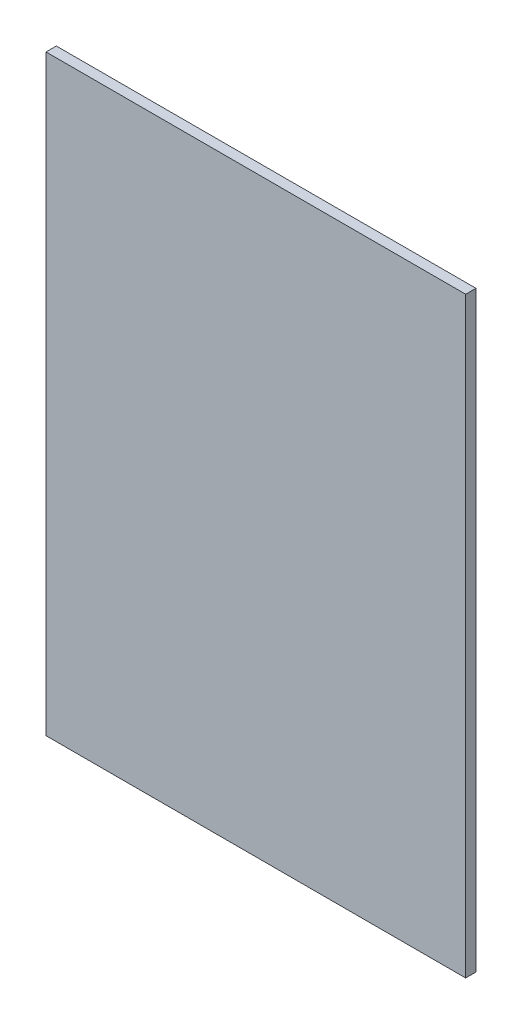
ISO-10303-21;
HEADER;
FILE_DESCRIPTION(('STEP AP214'),'2;1');
FILE_NAME('part.step','',(''),(''),'','','');
FILE_SCHEMA(('AUTOMOTIVE_DESIGN { 1 0 10303 214 1 1 1 1 }'));
ENDSEC;
DATA;
#1=APPLICATION_CONTEXT('core data for automotive mechanical design processes');
#2=APPLICATION_PROTOCOL_DEFINITION('international standard','automotive_design',2000,#1);
#3=PRODUCT_CONTEXT('',#1,'mechanical');
#4=PRODUCT('Part','Part','',(#3));
#5=PRODUCT_RELATED_PRODUCT_CATEGORY('part','',(#4));
#6=PRODUCT_DEFINITION_FORMATION('','',#4);
#7=PRODUCT_DEFINITION_CONTEXT('part definition',#1,'design');
#8=PRODUCT_DEFINITION('design','',#6,#7);
#9=PRODUCT_DEFINITION_SHAPE('','',#8);
#10=(LENGTH_UNIT() NAMED_UNIT(*) SI_UNIT(.MILLI.,.METRE.));
#11=(NAMED_UNIT(*) PLANE_ANGLE_UNIT() SI_UNIT($,.RADIAN.));
#12=(NAMED_UNIT(*) SI_UNIT($,.STERADIAN.) SOLID_ANGLE_UNIT());
#13=UNCERTAINTY_MEASURE_WITH_UNIT(LENGTH_MEASURE(1.E-05),#10,'distance_accuracy_value','');
#14=(GEOMETRIC_REPRESENTATION_CONTEXT(3) GLOBAL_UNCERTAINTY_ASSIGNED_CONTEXT((#13)) GLOBAL_UNIT_ASSIGNED_CONTEXT((#10,
#11,#12)) REPRESENTATION_CONTEXT('',''));
#15=CARTESIAN_POINT('',(0.,0.,0.));
#16=DIRECTION('',(0.,0.,1.));
#17=DIRECTION('',(1.,0.,0.));
#18=AXIS2_PLACEMENT_3D('',#15,#16,#17);
#19=CARTESIAN_POINT('',(103.505,146.05,2.54));
#20=DIRECTION('',(-1.,0.,0.));
#21=DIRECTION('',(0.,-1.,0.));
#22=AXIS2_PLACEMENT_3D('',#19,#20,#21);
#23=PLANE('',#22);
#24=DIRECTION('',(0.,1.,0.));
#25=VECTOR('',#24,1.);
#26=CARTESIAN_POINT('',(103.505,146.05,-2.54));
#27=LINE('',#26,#25);
#28=CARTESIAN_POINT('',(103.505,-146.05,-2.54));
#29=VERTEX_POINT('',#28);
#30=CARTESIAN_POINT('',(103.505,146.05,-2.54));
#31=VERTEX_POINT('',#30);
#32=EDGE_CURVE('E98',#29,#31,#27,.T.);
#33=ORIENTED_EDGE('',*,*,#32,.T.);
#34=DIRECTION('',(0.,0.,-1.));
#35=VECTOR('',#34,1.);
#36=CARTESIAN_POINT('',(103.505,146.05,2.54));
#37=LINE('',#36,#35);
#38=CARTESIAN_POINT('',(103.505,146.05,2.54));
#39=VERTEX_POINT('',#38);
#40=EDGE_CURVE('E11',#39,#31,#37,.T.);
#41=ORIENTED_EDGE('',*,*,#40,.F.);
#42=DIRECTION('',(0.,1.,0.));
#43=VECTOR('',#42,1.);
#44=CARTESIAN_POINT('',(103.505,146.05,2.54));
#45=LINE('',#44,#43);
#46=CARTESIAN_POINT('',(103.505,-146.05,2.54));
#47=VERTEX_POINT('',#46);
#48=EDGE_CURVE('E86',#47,#39,#45,.T.);
#49=ORIENTED_EDGE('',*,*,#48,.F.);
#50=DIRECTION('',(0.,0.,-1.));
#51=VECTOR('',#50,1.);
#52=CARTESIAN_POINT('',(103.505,-146.05,2.54));
#53=LINE('',#52,#51);
#54=EDGE_CURVE('E94',#47,#29,#53,.T.);
#55=ORIENTED_EDGE('',*,*,#54,.T.);
#56=EDGE_LOOP('',(#33,#41,#49,#55));
#57=FACE_BOUND('',#56,.T.);
#58=ADVANCED_FACE('F35',(#57),#23,.F.);
#59=CARTESIAN_POINT('',(-103.505,146.05,2.54));
#60=DIRECTION('',(0.,-1.,0.));
#61=DIRECTION('',(0.,0.,-1.));
#62=AXIS2_PLACEMENT_3D('',#59,#60,#61);
#63=PLANE('',#62);
#64=DIRECTION('',(-1.,0.,0.));
#65=VECTOR('',#64,1.);
#66=CARTESIAN_POINT('',(-103.505,146.05,-2.54));
#67=LINE('',#66,#65);
#68=CARTESIAN_POINT('',(-103.505,146.05,-2.54));
#69=VERTEX_POINT('',#68);
#70=EDGE_CURVE('E90',#31,#69,#67,.T.);
#71=ORIENTED_EDGE('',*,*,#70,.T.);
#72=DIRECTION('',(0.,0.,-1.));
#73=VECTOR('',#72,1.);
#74=CARTESIAN_POINT('',(-103.505,146.05,2.54));
#75=LINE('',#74,#73);
#76=CARTESIAN_POINT('',(-103.505,146.05,2.54));
#77=VERTEX_POINT('',#76);
#78=EDGE_CURVE('E43',#77,#69,#75,.T.);
#79=ORIENTED_EDGE('',*,*,#78,.F.);
#80=DIRECTION('',(-1.,0.,0.));
#81=VECTOR('',#80,1.);
#82=CARTESIAN_POINT('',(-103.505,146.05,2.54));
#83=LINE('',#82,#81);
#84=EDGE_CURVE('E81',#39,#77,#83,.T.);
#85=ORIENTED_EDGE('',*,*,#84,.F.);
#86=ORIENTED_EDGE('',*,*,#40,.T.);
#87=EDGE_LOOP('',(#71,#79,#85,#86));
#88=FACE_BOUND('',#87,.T.);
#89=ADVANCED_FACE('F89',(#88),#63,.F.);
#90=CARTESIAN_POINT('',(-103.505,146.05,2.54));
#91=DIRECTION('',(1.,0.,0.));
#92=DIRECTION('',(0.,1.,0.));
#93=AXIS2_PLACEMENT_3D('',#90,#91,#92);
#94=PLANE('',#93);
#95=DIRECTION('',(0.,-1.,0.));
#96=VECTOR('',#95,1.);
#97=CARTESIAN_POINT('',(-103.505,146.05,-2.54));
#98=LINE('',#97,#96);
#99=CARTESIAN_POINT('',(-103.505,-146.05,-2.54));
#100=VERTEX_POINT('',#99);
#101=EDGE_CURVE('E68',#69,#100,#98,.T.);
#102=ORIENTED_EDGE('',*,*,#101,.T.);
#103=DIRECTION('',(0.,0.,-1.));
#104=VECTOR('',#103,1.);
#105=CARTESIAN_POINT('',(-103.505,-146.05,2.54));
#106=LINE('',#105,#104);
#107=CARTESIAN_POINT('',(-103.505,-146.05,2.54));
#108=VERTEX_POINT('',#107);
#109=EDGE_CURVE('E91',#108,#100,#106,.T.);
#110=ORIENTED_EDGE('',*,*,#109,.F.);
#111=DIRECTION('',(0.,-1.,0.));
#112=VECTOR('',#111,1.);
#113=CARTESIAN_POINT('',(-103.505,146.05,2.54));
#114=LINE('',#113,#112);
#115=EDGE_CURVE('E84',#77,#108,#114,.T.);
#116=ORIENTED_EDGE('',*,*,#115,.F.);
#117=ORIENTED_EDGE('',*,*,#78,.T.);
#118=EDGE_LOOP('',(#102,#110,#116,#117));
#119=FACE_BOUND('',#118,.T.);
#120=ADVANCED_FACE('F92',(#119),#94,.F.);
#121=CARTESIAN_POINT('',(-103.505,-146.05,2.54));
#122=DIRECTION('',(0.,1.,0.));
#123=DIRECTION('',(0.,0.,1.));
#124=AXIS2_PLACEMENT_3D('',#121,#122,#123);
#125=PLANE('',#124);
#126=DIRECTION('',(1.,0.,0.));
#127=VECTOR('',#126,1.);
#128=CARTESIAN_POINT('',(-103.505,-146.05,-2.54));
#129=LINE('',#128,#127);
#130=EDGE_CURVE('E74',#100,#29,#129,.T.);
#131=ORIENTED_EDGE('',*,*,#130,.T.);
#132=ORIENTED_EDGE('',*,*,#54,.F.);
#133=DIRECTION('',(1.,0.,0.));
#134=VECTOR('',#133,1.);
#135=CARTESIAN_POINT('',(-103.505,-146.05,2.54));
#136=LINE('',#135,#134);
#137=EDGE_CURVE('E51',#108,#47,#136,.T.);
#138=ORIENTED_EDGE('',*,*,#137,.F.);
#139=ORIENTED_EDGE('',*,*,#109,.T.);
#140=EDGE_LOOP('',(#131,#132,#138,#139));
#141=FACE_BOUND('',#140,.T.);
#142=ADVANCED_FACE('F105',(#141),#125,.F.);
#143=CARTESIAN_POINT('',(0.,0.,2.54));
#144=DIRECTION('',(0.,0.,1.));
#145=DIRECTION('',(1.,0.,0.));
#146=AXIS2_PLACEMENT_3D('',#143,#144,#145);
#147=PLANE('',#146);
#148=ORIENTED_EDGE('',*,*,#48,.T.);
#149=ORIENTED_EDGE('',*,*,#84,.T.);
#150=ORIENTED_EDGE('',*,*,#115,.T.);
#151=ORIENTED_EDGE('',*,*,#137,.T.);
#152=EDGE_LOOP('',(#148,#149,#150,#151));
#153=FACE_BOUND('',#152,.T.);
#154=ADVANCED_FACE('F82',(#153),#147,.T.);
#155=CARTESIAN_POINT('',(0.,0.,-2.54));
#156=DIRECTION('',(0.,0.,1.));
#157=DIRECTION('',(1.,0.,0.));
#158=AXIS2_PLACEMENT_3D('',#155,#156,#157);
#159=PLANE('',#158);
#160=ORIENTED_EDGE('',*,*,#32,.F.);
#161=ORIENTED_EDGE('',*,*,#130,.F.);
#162=ORIENTED_EDGE('',*,*,#101,.F.);
#163=ORIENTED_EDGE('',*,*,#70,.F.);
#164=EDGE_LOOP('',(#160,#161,#162,#163));
#165=FACE_BOUND('',#164,.T.);
#166=ADVANCED_FACE('F108',(#165),#159,.F.);
#167=CLOSED_SHELL('',(#58,#89,#120,#142,#154,#166));
#168=MANIFOLD_SOLID_BREP('B2',#167);
#169=ADVANCED_BREP_SHAPE_REPRESENTATION('',(#18,#168),#14);
#170=SHAPE_DEFINITION_REPRESENTATION(#9,#169);
ENDSEC;
END-ISO-10303-21;
